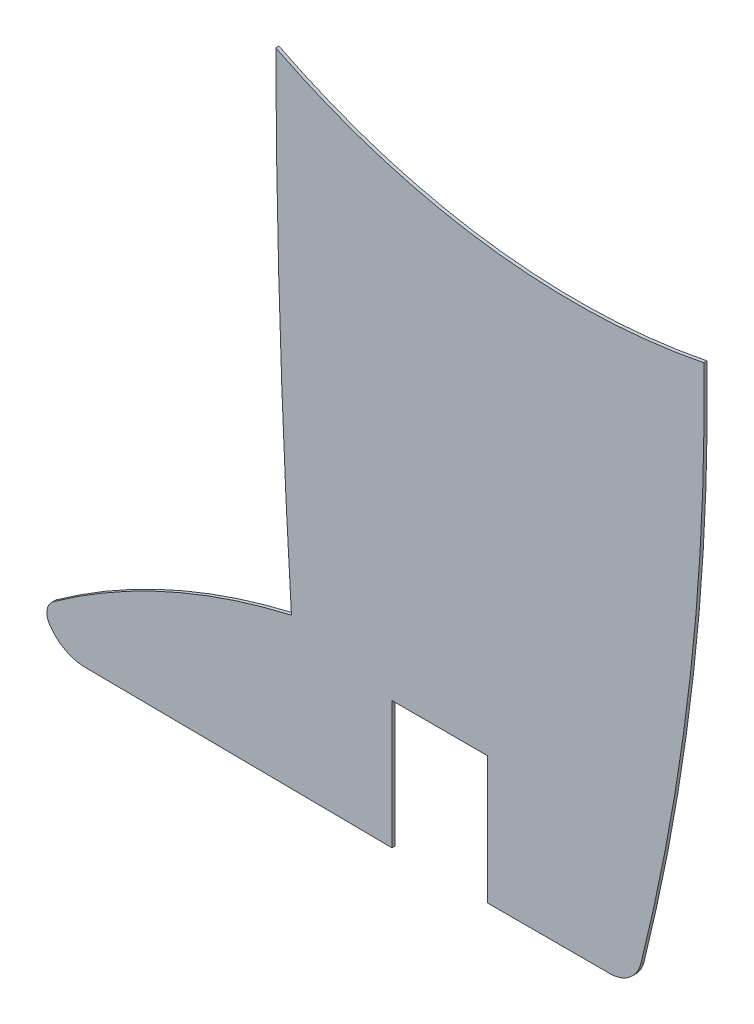
ISO-10303-21;
HEADER;
FILE_DESCRIPTION(('STEP AP214'),'2;1');
FILE_NAME('part.step','',(''),(''),'','','');
FILE_SCHEMA(('AUTOMOTIVE_DESIGN { 1 0 10303 214 1 1 1 1 }'));
ENDSEC;
DATA;
#1=APPLICATION_CONTEXT('core data for automotive mechanical design processes');
#2=APPLICATION_PROTOCOL_DEFINITION('international standard','automotive_design',2000,#1);
#3=PRODUCT_CONTEXT('',#1,'mechanical');
#4=PRODUCT('Part','Part','',(#3));
#5=PRODUCT_RELATED_PRODUCT_CATEGORY('part','',(#4));
#6=PRODUCT_DEFINITION_FORMATION('','',#4);
#7=PRODUCT_DEFINITION_CONTEXT('part definition',#1,'design');
#8=PRODUCT_DEFINITION('design','',#6,#7);
#9=PRODUCT_DEFINITION_SHAPE('','',#8);
#10=(LENGTH_UNIT() NAMED_UNIT(*) SI_UNIT(.MILLI.,.METRE.));
#11=(NAMED_UNIT(*) PLANE_ANGLE_UNIT() SI_UNIT($,.RADIAN.));
#12=(NAMED_UNIT(*) SI_UNIT($,.STERADIAN.) SOLID_ANGLE_UNIT());
#13=UNCERTAINTY_MEASURE_WITH_UNIT(LENGTH_MEASURE(1.E-05),#10,'distance_accuracy_value','');
#14=(GEOMETRIC_REPRESENTATION_CONTEXT(3) GLOBAL_UNCERTAINTY_ASSIGNED_CONTEXT((#13)) GLOBAL_UNIT_ASSIGNED_CONTEXT((#10,
#11,#12)) REPRESENTATION_CONTEXT('',''));
#15=CARTESIAN_POINT('',(0.,0.,0.));
#16=DIRECTION('',(0.,0.,1.));
#17=DIRECTION('',(1.,0.,0.));
#18=AXIS2_PLACEMENT_3D('',#15,#16,#17);
#19=CARTESIAN_POINT('',(284.863642758592,-25.9235318979306,0.1));
#20=DIRECTION('',(0.,0.,-1.));
#21=DIRECTION('',(-1.,0.,0.));
#22=AXIS2_PLACEMENT_3D('',#19,#20,#21);
#23=CYLINDRICAL_SURFACE('',#22,261.092616310646);
#24=CARTESIAN_POINT('',(284.863642758592,-25.9235318979306,0.));
#25=DIRECTION('',(0.,0.,1.));
#26=DIRECTION('',(1.,0.,0.));
#27=AXIS2_PLACEMENT_3D('',#24,#25,#26);
#28=CIRCLE('',#27,261.092616310646);
#29=CARTESIAN_POINT('',(23.7724901474191,-26.7977859268856,0.));
#30=VERTEX_POINT('',#29);
#31=CARTESIAN_POINT('',(24.2643939908151,-41.9667807462238,0.));
#32=VERTEX_POINT('',#31);
#33=EDGE_CURVE('E153',#30,#32,#28,.T.);
#34=ORIENTED_EDGE('',*,*,#33,.T.);
#35=DIRECTION('',(0.,0.,-1.));
#36=VECTOR('',#35,1.);
#37=CARTESIAN_POINT('',(24.2643939908151,-41.9667807462238,0.1));
#38=LINE('',#37,#36);
#39=CARTESIAN_POINT('',(24.2643939908151,-41.9667807462238,0.1));
#40=VERTEX_POINT('',#39);
#41=EDGE_CURVE('E11',#40,#32,#38,.T.);
#42=ORIENTED_EDGE('',*,*,#41,.F.);
#43=CARTESIAN_POINT('',(284.863642758592,-25.9235318979306,0.1));
#44=DIRECTION('',(0.,0.,1.));
#45=DIRECTION('',(1.,0.,0.));
#46=AXIS2_PLACEMENT_3D('',#43,#44,#45);
#47=CIRCLE('',#46,261.092616310646);
#48=CARTESIAN_POINT('',(23.7724901474191,-26.7977859268856,0.1));
#49=VERTEX_POINT('',#48);
#50=EDGE_CURVE('E175',#49,#40,#47,.T.);
#51=ORIENTED_EDGE('',*,*,#50,.F.);
#52=DIRECTION('',(0.,0.,-1.));
#53=VECTOR('',#52,1.);
#54=CARTESIAN_POINT('',(23.7724901474191,-26.7977859268856,0.1));
#55=LINE('',#54,#53);
#56=EDGE_CURVE('E149',#49,#30,#55,.T.);
#57=ORIENTED_EDGE('',*,*,#56,.T.);
#58=EDGE_LOOP('',(#34,#42,#51,#57));
#59=FACE_BOUND('',#58,.T.);
#60=ADVANCED_FACE('F33',(#59),#23,.T.);
#61=CARTESIAN_POINT('',(28.9290641347133,-62.2857209234554,0.1));
#62=DIRECTION('',(0.,0.,-1.));
#63=DIRECTION('',(-1.,0.,0.));
#64=AXIS2_PLACEMENT_3D('',#61,#62,#63);
#65=CYLINDRICAL_SURFACE('',#64,20.8475053058463);
#66=CARTESIAN_POINT('',(28.9290641347133,-62.2857209234554,0.));
#67=DIRECTION('',(0.,0.,1.));
#68=DIRECTION('',(1.,0.,0.));
#69=AXIS2_PLACEMENT_3D('',#66,#67,#68);
#70=CIRCLE('',#69,20.8475053058463);
#71=CARTESIAN_POINT('',(16.7941230369973,-45.3339752306882,0.));
#72=VERTEX_POINT('',#71);
#73=EDGE_CURVE('E156',#32,#72,#70,.T.);
#74=ORIENTED_EDGE('',*,*,#73,.T.);
#75=DIRECTION('',(0.,0.,-1.));
#76=VECTOR('',#75,1.);
#77=CARTESIAN_POINT('',(16.7941230369973,-45.3339752306882,0.1));
#78=LINE('',#77,#76);
#79=CARTESIAN_POINT('',(16.7941230369973,-45.3339752306882,0.1));
#80=VERTEX_POINT('',#79);
#81=EDGE_CURVE('E41',#80,#72,#78,.T.);
#82=ORIENTED_EDGE('',*,*,#81,.F.);
#83=CARTESIAN_POINT('',(28.9290641347133,-62.2857209234554,0.1));
#84=DIRECTION('',(0.,0.,1.));
#85=DIRECTION('',(1.,0.,0.));
#86=AXIS2_PLACEMENT_3D('',#83,#84,#85);
#87=CIRCLE('',#86,20.8475053058463);
#88=EDGE_CURVE('E104',#40,#80,#87,.T.);
#89=ORIENTED_EDGE('',*,*,#88,.F.);
#90=ORIENTED_EDGE('',*,*,#41,.T.);
#91=EDGE_LOOP('',(#74,#82,#89,#90));
#92=FACE_BOUND('',#91,.T.);
#93=ADVANCED_FACE('F253',(#92),#65,.T.);
#94=CARTESIAN_POINT('',(17.090800820254,-45.7364454692424,0.1));
#95=DIRECTION('',(0.,0.,-1.));
#96=DIRECTION('',(-1.,0.,0.));
#97=AXIS2_PLACEMENT_3D('',#94,#95,#96);
#98=CYLINDRICAL_SURFACE('',#97,0.499999999999997);
#99=CARTESIAN_POINT('',(17.090800820254,-45.7364454692424,0.));
#100=DIRECTION('',(0.,0.,1.));
#101=DIRECTION('',(1.,0.,0.));
#102=AXIS2_PLACEMENT_3D('',#99,#100,#101);
#103=CIRCLE('',#102,0.499999999999997);
#104=CARTESIAN_POINT('',(16.6739137654097,-46.0124983328451,0.));
#105=VERTEX_POINT('',#104);
#106=EDGE_CURVE('E158',#72,#105,#103,.T.);
#107=ORIENTED_EDGE('',*,*,#106,.T.);
#108=DIRECTION('',(0.,0.,-1.));
#109=VECTOR('',#108,1.);
#110=CARTESIAN_POINT('',(16.6739137654097,-46.0124983328451,0.1));
#111=LINE('',#110,#109);
#112=CARTESIAN_POINT('',(16.6739137654097,-46.0124983328451,0.1));
#113=VERTEX_POINT('',#112);
#114=EDGE_CURVE('E194',#113,#105,#111,.T.);
#115=ORIENTED_EDGE('',*,*,#114,.F.);
#116=CARTESIAN_POINT('',(17.090800820254,-45.7364454692424,0.1));
#117=DIRECTION('',(0.,0.,1.));
#118=DIRECTION('',(1.,0.,0.));
#119=AXIS2_PLACEMENT_3D('',#116,#117,#118);
#120=CIRCLE('',#119,0.499999999999997);
#121=EDGE_CURVE('E202',#80,#113,#120,.T.);
#122=ORIENTED_EDGE('',*,*,#121,.F.);
#123=ORIENTED_EDGE('',*,*,#81,.T.);
#124=EDGE_LOOP('',(#107,#115,#122,#123));
#125=FACE_BOUND('',#124,.T.);
#126=ADVANCED_FACE('F200',(#125),#98,.T.);
#127=CARTESIAN_POINT('',(17.8087828292726,-45.2610145646323,0.1));
#128=DIRECTION('',(0.,0.,-1.));
#129=DIRECTION('',(-1.,0.,0.));
#130=AXIS2_PLACEMENT_3D('',#127,#128,#129);
#131=CYLINDRICAL_SURFACE('',#130,1.36112293566756);
#132=CARTESIAN_POINT('',(17.8087828292726,-45.2610145646323,0.));
#133=DIRECTION('',(0.,0.,1.));
#134=DIRECTION('',(1.,0.,0.));
#135=AXIS2_PLACEMENT_3D('',#132,#133,#134);
#136=CIRCLE('',#135,1.36112293566756);
#137=CARTESIAN_POINT('',(17.8557057461478,-46.6213284570381,0.));
#138=VERTEX_POINT('',#137);
#139=EDGE_CURVE('E160',#105,#138,#136,.T.);
#140=ORIENTED_EDGE('',*,*,#139,.T.);
#141=DIRECTION('',(0.,0.,-1.));
#142=VECTOR('',#141,1.);
#143=CARTESIAN_POINT('',(17.8557057461478,-46.6213284570381,0.1));
#144=LINE('',#143,#142);
#145=CARTESIAN_POINT('',(17.8557057461478,-46.6213284570381,0.1));
#146=VERTEX_POINT('',#145);
#147=EDGE_CURVE('E191',#146,#138,#144,.T.);
#148=ORIENTED_EDGE('',*,*,#147,.F.);
#149=CARTESIAN_POINT('',(17.8087828292726,-45.2610145646323,0.1));
#150=DIRECTION('',(0.,0.,1.));
#151=DIRECTION('',(1.,0.,0.));
#152=AXIS2_PLACEMENT_3D('',#149,#150,#151);
#153=CIRCLE('',#152,1.36112293566756);
#154=EDGE_CURVE('E220',#113,#146,#153,.T.);
#155=ORIENTED_EDGE('',*,*,#154,.F.);
#156=ORIENTED_EDGE('',*,*,#114,.T.);
#157=EDGE_LOOP('',(#140,#148,#155,#156));
#158=FACE_BOUND('',#157,.T.);
#159=ADVANCED_FACE('F211',(#158),#131,.T.);
#160=CARTESIAN_POINT('',(27.4191250657805,-46.7119016054983,0.1));
#161=DIRECTION('',(0.00947036657987621,0.999955155072888,0.));
#162=DIRECTION('',(-0.999955155072888,0.00947036657987621,0.));
#163=AXIS2_PLACEMENT_3D('',#160,#161,#162);
#164=PLANE('',#163);
#165=DIRECTION('',(0.999955155072888,-0.00947036657987621,0.));
#166=VECTOR('',#165,1.);
#167=CARTESIAN_POINT('',(27.4191250657805,-46.7119016054983,0.));
#168=LINE('',#167,#166);
#169=CARTESIAN_POINT('',(27.4191250657805,-46.7119016054983,0.));
#170=VERTEX_POINT('',#169);
#171=EDGE_CURVE('E162',#138,#170,#168,.T.);
#172=ORIENTED_EDGE('',*,*,#171,.T.);
#173=DIRECTION('',(0.,0.,-1.));
#174=VECTOR('',#173,1.);
#175=CARTESIAN_POINT('',(27.4191250657805,-46.7119016054983,0.1));
#176=LINE('',#175,#174);
#177=CARTESIAN_POINT('',(27.4191250657805,-46.7119016054983,0.1));
#178=VERTEX_POINT('',#177);
#179=EDGE_CURVE('E188',#178,#170,#176,.T.);
#180=ORIENTED_EDGE('',*,*,#179,.F.);
#181=DIRECTION('',(0.999955155072888,-0.00947036657987621,0.));
#182=VECTOR('',#181,1.);
#183=CARTESIAN_POINT('',(27.4191250657805,-46.7119016054983,0.1));
#184=LINE('',#183,#182);
#185=EDGE_CURVE('E217',#146,#178,#184,.T.);
#186=ORIENTED_EDGE('',*,*,#185,.F.);
#187=ORIENTED_EDGE('',*,*,#147,.T.);
#188=EDGE_LOOP('',(#172,#180,#186,#187));
#189=FACE_BOUND('',#188,.T.);
#190=ADVANCED_FACE('F215',(#189),#164,.F.);
#191=CARTESIAN_POINT('',(27.4191407973545,-42.7102405432427,0.1));
#192=DIRECTION('',(-0.999999999992272,3.93126097791093E-06,0.));
#193=DIRECTION('',(-3.93126097791093E-06,-0.999999999992273,0.));
#194=AXIS2_PLACEMENT_3D('',#191,#192,#193);
#195=PLANE('',#194);
#196=DIRECTION('',(3.93126097791093E-06,0.999999999992273,0.));
#197=VECTOR('',#196,1.);
#198=CARTESIAN_POINT('',(27.4191407973545,-42.7102405432427,0.));
#199=LINE('',#198,#197);
#200=CARTESIAN_POINT('',(27.4191407973545,-42.7102405432427,0.));
#201=VERTEX_POINT('',#200);
#202=EDGE_CURVE('E164',#170,#201,#199,.T.);
#203=ORIENTED_EDGE('',*,*,#202,.T.);
#204=DIRECTION('',(0.,0.,-1.));
#205=VECTOR('',#204,1.);
#206=CARTESIAN_POINT('',(27.4191407973545,-42.7102405432427,0.1));
#207=LINE('',#206,#205);
#208=CARTESIAN_POINT('',(27.4191407973545,-42.7102405432427,0.1));
#209=VERTEX_POINT('',#208);
#210=EDGE_CURVE('E185',#209,#201,#207,.T.);
#211=ORIENTED_EDGE('',*,*,#210,.F.);
#212=DIRECTION('',(3.93126097791093E-06,0.999999999992273,0.));
#213=VECTOR('',#212,1.);
#214=CARTESIAN_POINT('',(27.4191407973545,-42.7102405432427,0.1));
#215=LINE('',#214,#213);
#216=EDGE_CURVE('E219',#178,#209,#215,.T.);
#217=ORIENTED_EDGE('',*,*,#216,.F.);
#218=ORIENTED_EDGE('',*,*,#179,.T.);
#219=EDGE_LOOP('',(#203,#211,#217,#218));
#220=FACE_BOUND('',#219,.T.);
#221=ADVANCED_FACE('F266',(#220),#195,.F.);
#222=CARTESIAN_POINT('',(30.4191407973545,-42.7102405432426,0.1));
#223=DIRECTION('',(0.,1.,0.));
#224=DIRECTION('',(-1.,0.,0.));
#225=AXIS2_PLACEMENT_3D('',#222,#223,#224);
#226=PLANE('',#225);
#227=DIRECTION('',(1.,0.,0.));
#228=VECTOR('',#227,1.);
#229=CARTESIAN_POINT('',(30.4191407973545,-42.7102405432426,0.));
#230=LINE('',#229,#228);
#231=CARTESIAN_POINT('',(30.4191407973545,-42.7102405432426,0.));
#232=VERTEX_POINT('',#231);
#233=EDGE_CURVE('E166',#201,#232,#230,.T.);
#234=ORIENTED_EDGE('',*,*,#233,.T.);
#235=DIRECTION('',(0.,0.,-1.));
#236=VECTOR('',#235,1.);
#237=CARTESIAN_POINT('',(30.4191407973545,-42.7102405432426,0.1));
#238=LINE('',#237,#236);
#239=CARTESIAN_POINT('',(30.4191407973545,-42.7102405432426,0.1));
#240=VERTEX_POINT('',#239);
#241=EDGE_CURVE('E182',#240,#232,#238,.T.);
#242=ORIENTED_EDGE('',*,*,#241,.F.);
#243=DIRECTION('',(1.,0.,0.));
#244=VECTOR('',#243,1.);
#245=CARTESIAN_POINT('',(30.4191407973545,-42.7102405432426,0.1));
#246=LINE('',#245,#244);
#247=EDGE_CURVE('E222',#209,#240,#246,.T.);
#248=ORIENTED_EDGE('',*,*,#247,.F.);
#249=ORIENTED_EDGE('',*,*,#210,.T.);
#250=EDGE_LOOP('',(#234,#242,#248,#249));
#251=FACE_BOUND('',#250,.T.);
#252=ADVANCED_FACE('F269',(#251),#226,.F.);
#253=CARTESIAN_POINT('',(30.4191409850099,-46.7115403885,0.1));
#254=DIRECTION('',(0.999999999999999,4.6898602370891E-08,0.));
#255=DIRECTION('',(-4.6898602370891E-08,0.999999999999999,0.));
#256=AXIS2_PLACEMENT_3D('',#253,#254,#255);
#257=PLANE('',#256);
#258=DIRECTION('',(4.6898602370891E-08,-0.999999999999999,0.));
#259=VECTOR('',#258,1.);
#260=CARTESIAN_POINT('',(30.4191409850099,-46.7115403885,0.));
#261=LINE('',#260,#259);
#262=CARTESIAN_POINT('',(30.4191409850099,-46.7115403885,0.));
#263=VERTEX_POINT('',#262);
#264=EDGE_CURVE('E168',#232,#263,#261,.T.);
#265=ORIENTED_EDGE('',*,*,#264,.T.);
#266=DIRECTION('',(0.,0.,-1.));
#267=VECTOR('',#266,1.);
#268=CARTESIAN_POINT('',(30.4191409850099,-46.7115403885,0.1));
#269=LINE('',#268,#267);
#270=CARTESIAN_POINT('',(30.4191409850099,-46.7115403885,0.1));
#271=VERTEX_POINT('',#270);
#272=EDGE_CURVE('E179',#271,#263,#269,.T.);
#273=ORIENTED_EDGE('',*,*,#272,.F.);
#274=DIRECTION('',(4.6898602370891E-08,-0.999999999999999,0.));
#275=VECTOR('',#274,1.);
#276=CARTESIAN_POINT('',(30.4191409850099,-46.7115403885,0.1));
#277=LINE('',#276,#275);
#278=EDGE_CURVE('E228',#240,#271,#277,.T.);
#279=ORIENTED_EDGE('',*,*,#278,.F.);
#280=ORIENTED_EDGE('',*,*,#241,.T.);
#281=EDGE_LOOP('',(#265,#273,#279,#280));
#282=FACE_BOUND('',#281,.T.);
#283=ADVANCED_FACE('F234',(#282),#257,.F.);
#284=CARTESIAN_POINT('',(34.2580123910908,-46.7109861805527,0.1));
#285=DIRECTION('',(-0.00014436741504838,0.999999989579025,0.));
#286=DIRECTION('',(-0.999999989579025,-0.00014436741504838,0.));
#287=AXIS2_PLACEMENT_3D('',#284,#285,#286);
#288=PLANE('',#287);
#289=DIRECTION('',(0.999999989579025,0.00014436741504838,0.));
#290=VECTOR('',#289,1.);
#291=CARTESIAN_POINT('',(34.2580123910908,-46.7109861805527,0.));
#292=LINE('',#291,#290);
#293=CARTESIAN_POINT('',(34.2580123910908,-46.7109861805527,0.));
#294=VERTEX_POINT('',#293);
#295=EDGE_CURVE('E170',#263,#294,#292,.T.);
#296=ORIENTED_EDGE('',*,*,#295,.T.);
#297=DIRECTION('',(0.,0.,-1.));
#298=VECTOR('',#297,1.);
#299=CARTESIAN_POINT('',(34.2580123910908,-46.7109861805527,0.1));
#300=LINE('',#299,#298);
#301=CARTESIAN_POINT('',(34.2580123910908,-46.7109861805527,0.1));
#302=VERTEX_POINT('',#301);
#303=EDGE_CURVE('E144',#302,#294,#300,.T.);
#304=ORIENTED_EDGE('',*,*,#303,.F.);
#305=DIRECTION('',(0.999999989579025,0.00014436741504838,0.));
#306=VECTOR('',#305,1.);
#307=CARTESIAN_POINT('',(34.2580123910908,-46.7109861805527,0.1));
#308=LINE('',#307,#306);
#309=EDGE_CURVE('E135',#271,#302,#308,.T.);
#310=ORIENTED_EDGE('',*,*,#309,.F.);
#311=ORIENTED_EDGE('',*,*,#272,.T.);
#312=EDGE_LOOP('',(#296,#304,#310,#311));
#313=FACE_BOUND('',#312,.T.);
#314=ADVANCED_FACE('F238',(#313),#288,.F.);
#315=CARTESIAN_POINT('',(34.2578680236757,-45.7109861909736,0.1));
#316=DIRECTION('',(0.,0.,-1.));
#317=DIRECTION('',(-1.,0.,0.));
#318=AXIS2_PLACEMENT_3D('',#315,#316,#317);
#319=CYLINDRICAL_SURFACE('',#318,0.999999999999995);
#320=CARTESIAN_POINT('',(34.2578680236757,-45.7109861909736,0.));
#321=DIRECTION('',(0.,0.,1.));
#322=DIRECTION('',(1.,0.,0.));
#323=AXIS2_PLACEMENT_3D('',#320,#321,#322);
#324=CIRCLE('',#323,0.999999999999995);
#325=CARTESIAN_POINT('',(35.2266150121539,-45.9590371379877,0.));
#326=VERTEX_POINT('',#325);
#327=EDGE_CURVE('E143',#294,#326,#324,.T.);
#328=ORIENTED_EDGE('',*,*,#327,.T.);
#329=DIRECTION('',(0.,0.,-1.));
#330=VECTOR('',#329,1.);
#331=CARTESIAN_POINT('',(35.2266150121539,-45.9590371379877,0.1));
#332=LINE('',#331,#330);
#333=CARTESIAN_POINT('',(35.2266150121539,-45.9590371379877,0.1));
#334=VERTEX_POINT('',#333);
#335=EDGE_CURVE('E140',#334,#326,#332,.T.);
#336=ORIENTED_EDGE('',*,*,#335,.F.);
#337=CARTESIAN_POINT('',(34.2578680236757,-45.7109861909736,0.1));
#338=DIRECTION('',(0.,0.,1.));
#339=DIRECTION('',(1.,0.,0.));
#340=AXIS2_PLACEMENT_3D('',#337,#338,#339);
#341=CIRCLE('',#340,0.999999999999995);
#342=EDGE_CURVE('E129',#302,#334,#341,.T.);
#343=ORIENTED_EDGE('',*,*,#342,.F.);
#344=ORIENTED_EDGE('',*,*,#303,.T.);
#345=EDGE_LOOP('',(#328,#336,#343,#344));
#346=FACE_BOUND('',#345,.T.);
#347=ADVANCED_FACE('F141',(#346),#319,.T.);
#348=CARTESIAN_POINT('',(-29.9983072690269,-29.7521812859999,0.1));
#349=DIRECTION('',(0.,0.,-1.));
#350=DIRECTION('',(-1.,0.,0.));
#351=AXIS2_PLACEMENT_3D('',#348,#349,#350);
#352=CYLINDRICAL_SURFACE('',#351,67.2082782341073);
#353=CARTESIAN_POINT('',(-29.9983072690269,-29.7521812859999,0.));
#354=DIRECTION('',(0.,0.,1.));
#355=DIRECTION('',(1.,0.,0.));
#356=AXIS2_PLACEMENT_3D('',#353,#354,#355);
#357=CIRCLE('',#356,67.2082782341073);
#358=CARTESIAN_POINT('',(37.2007408416091,-28.6383607359976,0.));
#359=VERTEX_POINT('',#358);
#360=EDGE_CURVE('E90',#326,#359,#357,.T.);
#361=ORIENTED_EDGE('',*,*,#360,.T.);
#362=DIRECTION('',(0.,0.,-1.));
#363=VECTOR('',#362,1.);
#364=CARTESIAN_POINT('',(37.2007408416091,-28.6383607359976,0.1));
#365=LINE('',#364,#363);
#366=CARTESIAN_POINT('',(37.2007408416091,-28.6383607359976,0.1));
#367=VERTEX_POINT('',#366);
#368=EDGE_CURVE('E145',#367,#359,#365,.T.);
#369=ORIENTED_EDGE('',*,*,#368,.F.);
#370=CARTESIAN_POINT('',(-29.9983072690269,-29.7521812859999,0.1));
#371=DIRECTION('',(0.,0.,1.));
#372=DIRECTION('',(1.,0.,0.));
#373=AXIS2_PLACEMENT_3D('',#370,#371,#372);
#374=CIRCLE('',#373,67.2082782341073);
#375=EDGE_CURVE('E133',#334,#367,#374,.T.);
#376=ORIENTED_EDGE('',*,*,#375,.F.);
#377=ORIENTED_EDGE('',*,*,#335,.T.);
#378=EDGE_LOOP('',(#361,#369,#376,#377));
#379=FACE_BOUND('',#378,.T.);
#380=ADVANCED_FACE('F147',(#379),#352,.T.);
#381=CARTESIAN_POINT('',(33.1491788223175,-8.29285481932319,0.1));
#382=DIRECTION('',(0.,0.,-1.));
#383=DIRECTION('',(-1.,0.,0.));
#384=AXIS2_PLACEMENT_3D('',#381,#382,#383);
#385=CYLINDRICAL_SURFACE('',#384,20.7449937527491);
#386=CARTESIAN_POINT('',(33.1491788223175,-8.29285481932319,0.));
#387=DIRECTION('',(0.,0.,-1.));
#388=DIRECTION('',(1.,0.,0.));
#389=AXIS2_PLACEMENT_3D('',#386,#387,#388);
#390=CIRCLE('',#389,20.7449937527491);
#391=EDGE_CURVE('E96',#359,#30,#390,.T.);
#392=ORIENTED_EDGE('',*,*,#391,.T.);
#393=ORIENTED_EDGE('',*,*,#56,.F.);
#394=CARTESIAN_POINT('',(33.1491788223175,-8.29285481932319,0.1));
#395=DIRECTION('',(0.,0.,-1.));
#396=DIRECTION('',(1.,0.,0.));
#397=AXIS2_PLACEMENT_3D('',#394,#395,#396);
#398=CIRCLE('',#397,20.7449937527491);
#399=EDGE_CURVE('E49',#367,#49,#398,.T.);
#400=ORIENTED_EDGE('',*,*,#399,.F.);
#401=ORIENTED_EDGE('',*,*,#368,.T.);
#402=EDGE_LOOP('',(#392,#393,#400,#401));
#403=FACE_BOUND('',#402,.T.);
#404=ADVANCED_FACE('F242',(#403),#385,.F.);
#405=CARTESIAN_POINT('',(284.863642758592,-25.9235318979306,0.1));
#406=DIRECTION('',(0.,0.,1.));
#407=DIRECTION('',(1.,0.,0.));
#408=AXIS2_PLACEMENT_3D('',#405,#406,#407);
#409=PLANE('',#408);
#410=ORIENTED_EDGE('',*,*,#50,.T.);
#411=ORIENTED_EDGE('',*,*,#88,.T.);
#412=ORIENTED_EDGE('',*,*,#121,.T.);
#413=ORIENTED_EDGE('',*,*,#154,.T.);
#414=ORIENTED_EDGE('',*,*,#185,.T.);
#415=ORIENTED_EDGE('',*,*,#216,.T.);
#416=ORIENTED_EDGE('',*,*,#247,.T.);
#417=ORIENTED_EDGE('',*,*,#278,.T.);
#418=ORIENTED_EDGE('',*,*,#309,.T.);
#419=ORIENTED_EDGE('',*,*,#342,.T.);
#420=ORIENTED_EDGE('',*,*,#375,.T.);
#421=ORIENTED_EDGE('',*,*,#399,.T.);
#422=EDGE_LOOP('',(#410,#411,#412,#413,#414,#415,#416,#417,#418,#419,#420,#421));
#423=FACE_BOUND('',#422,.T.);
#424=ADVANCED_FACE('F131',(#423),#409,.T.);
#425=CARTESIAN_POINT('',(284.863642758592,-25.9235318979306,0.));
#426=DIRECTION('',(0.,0.,1.));
#427=DIRECTION('',(1.,0.,0.));
#428=AXIS2_PLACEMENT_3D('',#425,#426,#427);
#429=PLANE('',#428);
#430=ORIENTED_EDGE('',*,*,#33,.F.);
#431=ORIENTED_EDGE('',*,*,#391,.F.);
#432=ORIENTED_EDGE('',*,*,#360,.F.);
#433=ORIENTED_EDGE('',*,*,#327,.F.);
#434=ORIENTED_EDGE('',*,*,#295,.F.);
#435=ORIENTED_EDGE('',*,*,#264,.F.);
#436=ORIENTED_EDGE('',*,*,#233,.F.);
#437=ORIENTED_EDGE('',*,*,#202,.F.);
#438=ORIENTED_EDGE('',*,*,#171,.F.);
#439=ORIENTED_EDGE('',*,*,#139,.F.);
#440=ORIENTED_EDGE('',*,*,#106,.F.);
#441=ORIENTED_EDGE('',*,*,#73,.F.);
#442=EDGE_LOOP('',(#430,#431,#432,#433,#434,#435,#436,#437,#438,#439,#440,#441));
#443=FACE_BOUND('',#442,.T.);
#444=ADVANCED_FACE('F206',(#443),#429,.F.);
#445=CLOSED_SHELL('',(#60,#93,#126,#159,#190,#221,#252,#283,#314,#347,#380,#404,#424,#444));
#446=MANIFOLD_SOLID_BREP('B2',#445);
#447=ADVANCED_BREP_SHAPE_REPRESENTATION('',(#18,#446),#14);
#448=SHAPE_DEFINITION_REPRESENTATION(#9,#447);
ENDSEC;
END-ISO-10303-21;
